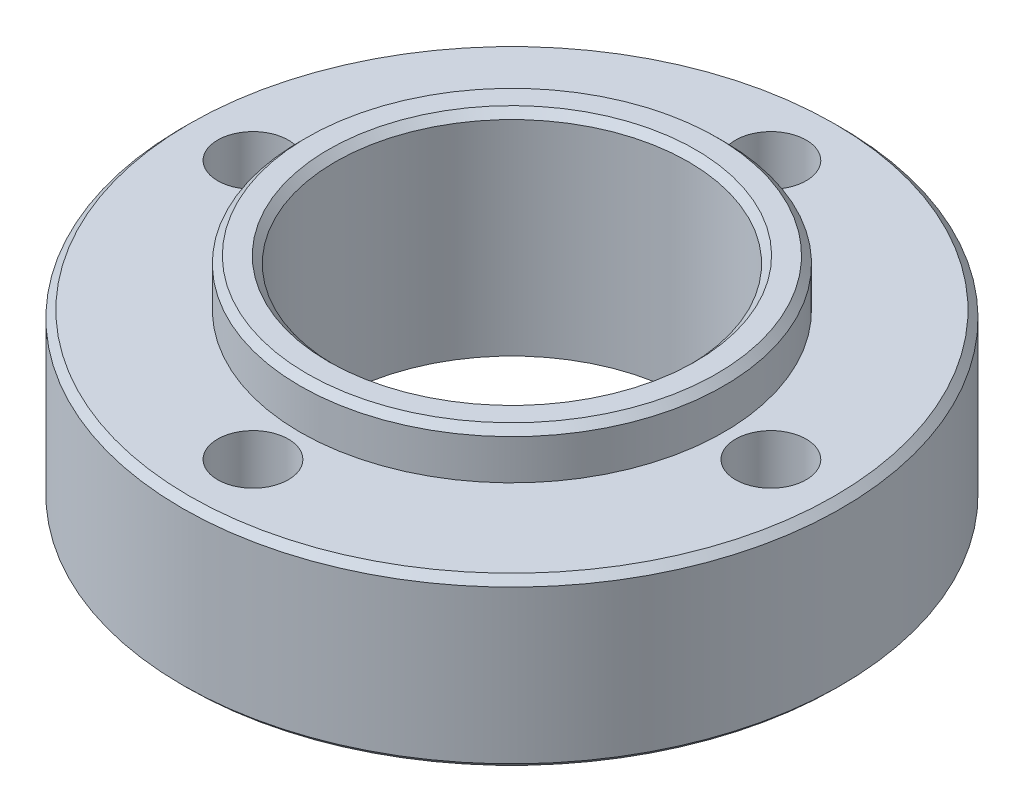
ISO-10303-21;
HEADER;
FILE_DESCRIPTION(('STEP AP214'),'2;1');
FILE_NAME('part.step','',(''),(''),'','','');
FILE_SCHEMA(('AUTOMOTIVE_DESIGN { 1 0 10303 214 1 1 1 1 }'));
ENDSEC;
DATA;
#1=APPLICATION_CONTEXT('core data for automotive mechanical design processes');
#2=APPLICATION_PROTOCOL_DEFINITION('international standard','automotive_design',2000,#1);
#3=PRODUCT_CONTEXT('',#1,'mechanical');
#4=PRODUCT('Part','Part','',(#3));
#5=PRODUCT_RELATED_PRODUCT_CATEGORY('part','',(#4));
#6=PRODUCT_DEFINITION_FORMATION('','',#4);
#7=PRODUCT_DEFINITION_CONTEXT('part definition',#1,'design');
#8=PRODUCT_DEFINITION('design','',#6,#7);
#9=PRODUCT_DEFINITION_SHAPE('','',#8);
#10=(LENGTH_UNIT() NAMED_UNIT(*) SI_UNIT(.MILLI.,.METRE.));
#11=(NAMED_UNIT(*) PLANE_ANGLE_UNIT() SI_UNIT($,.RADIAN.));
#12=(NAMED_UNIT(*) SI_UNIT($,.STERADIAN.) SOLID_ANGLE_UNIT());
#13=UNCERTAINTY_MEASURE_WITH_UNIT(LENGTH_MEASURE(1.E-05),#10,'distance_accuracy_value','');
#14=(GEOMETRIC_REPRESENTATION_CONTEXT(3) GLOBAL_UNCERTAINTY_ASSIGNED_CONTEXT((#13)) GLOBAL_UNIT_ASSIGNED_CONTEXT((#10,
#11,#12)) REPRESENTATION_CONTEXT('',''));
#15=CARTESIAN_POINT('',(0.,0.,0.));
#16=DIRECTION('',(0.,0.,1.));
#17=DIRECTION('',(1.,0.,0.));
#18=AXIS2_PLACEMENT_3D('',#15,#16,#17);
#19=CARTESIAN_POINT('',(0.,7.,0.));
#20=DIRECTION('',(0.,1.,0.));
#21=DIRECTION('',(0.,0.,1.));
#22=AXIS2_PLACEMENT_3D('',#19,#20,#21);
#23=PLANE('',#22);
#24=CARTESIAN_POINT('',(0.,7.,0.));
#25=DIRECTION('',(0.,1.,0.));
#26=DIRECTION('',(0.,0.,1.));
#27=AXIS2_PLACEMENT_3D('',#24,#25,#26);
#28=CIRCLE('',#27,13.7);
#29=CARTESIAN_POINT('',(0.,7.,13.7));
#30=VERTEX_POINT('',#29);
#31=EDGE_CURVE('E49',#30,#30,#28,.T.);
#32=ORIENTED_EDGE('',*,*,#31,.T.);
#33=EDGE_LOOP('',(#32));
#34=FACE_BOUND('',#33,.T.);
#35=CARTESIAN_POINT('',(0.,7.,-11.));
#36=DIRECTION('',(0.,1.,0.));
#37=DIRECTION('',(0.,0.,1.));
#38=AXIS2_PLACEMENT_3D('',#35,#36,#37);
#39=CIRCLE('',#38,1.5);
#40=CARTESIAN_POINT('',(0.,7.,-9.5));
#41=VERTEX_POINT('',#40);
#42=EDGE_CURVE('E66',#41,#41,#39,.T.);
#43=ORIENTED_EDGE('',*,*,#42,.F.);
#44=EDGE_LOOP('',(#43));
#45=FACE_BOUND('',#44,.T.);
#46=CARTESIAN_POINT('',(11.0000000000003,7.,-3.11291692255382E-13));
#47=DIRECTION('',(0.,1.,0.));
#48=DIRECTION('',(0.,0.,1.));
#49=AXIS2_PLACEMENT_3D('',#46,#47,#48);
#50=CIRCLE('',#49,1.50000000000024);
#51=CARTESIAN_POINT('',(11.0000000000003,7.,1.49999999999993));
#52=VERTEX_POINT('',#51);
#53=EDGE_CURVE('E86',#52,#52,#50,.T.);
#54=ORIENTED_EDGE('',*,*,#53,.F.);
#55=EDGE_LOOP('',(#54));
#56=FACE_BOUND('',#55,.T.);
#57=CARTESIAN_POINT('',(6.22583384510764E-13,7.,11.));
#58=DIRECTION('',(0.,1.,0.));
#59=DIRECTION('',(0.,0.,1.));
#60=AXIS2_PLACEMENT_3D('',#57,#58,#59);
#61=CIRCLE('',#60,1.50000000000067);
#62=CARTESIAN_POINT('',(6.22583384510764E-13,7.,12.5000000000007));
#63=VERTEX_POINT('',#62);
#64=EDGE_CURVE('E89',#63,#63,#61,.T.);
#65=ORIENTED_EDGE('',*,*,#64,.F.);
#66=EDGE_LOOP('',(#65));
#67=FACE_BOUND('',#66,.T.);
#68=CARTESIAN_POINT('',(-10.9999999999997,7.,3.12638803734444E-13));
#69=DIRECTION('',(0.,1.,0.));
#70=DIRECTION('',(0.,0.,1.));
#71=AXIS2_PLACEMENT_3D('',#68,#69,#70);
#72=CIRCLE('',#71,1.5000000000005);
#73=CARTESIAN_POINT('',(-10.9999999999997,7.,1.50000000000081));
#74=VERTEX_POINT('',#73);
#75=EDGE_CURVE('E70',#74,#74,#72,.T.);
#76=ORIENTED_EDGE('',*,*,#75,.F.);
#77=EDGE_LOOP('',(#76));
#78=FACE_BOUND('',#77,.T.);
#79=CARTESIAN_POINT('',(0.,7.,0.));
#80=DIRECTION('',(0.,1.,0.));
#81=DIRECTION('',(0.,0.,1.));
#82=AXIS2_PLACEMENT_3D('',#79,#80,#81);
#83=CIRCLE('',#82,9.);
#84=CARTESIAN_POINT('',(0.,7.,9.));
#85=VERTEX_POINT('',#84);
#86=EDGE_CURVE('E83',#85,#85,#83,.F.);
#87=ORIENTED_EDGE('',*,*,#86,.T.);
#88=EDGE_LOOP('',(#87));
#89=FACE_BOUND('',#88,.T.);
#90=ADVANCED_FACE('F34',(#34,#45,#56,#67,#78,#89),#23,.T.);
#91=CARTESIAN_POINT('',(0.,7.,0.));
#92=DIRECTION('',(0.,-1.,0.));
#93=DIRECTION('',(0.,0.,-1.));
#94=AXIS2_PLACEMENT_3D('',#91,#92,#93);
#95=CYLINDRICAL_SURFACE('',#94,14.);
#96=CARTESIAN_POINT('',(0.,0.200000000000006,0.));
#97=DIRECTION('',(0.,1.,0.));
#98=DIRECTION('',(0.,0.,1.));
#99=AXIS2_PLACEMENT_3D('',#96,#97,#98);
#100=CIRCLE('',#99,14.);
#101=CARTESIAN_POINT('',(0.,0.200000000000006,14.));
#102=VERTEX_POINT('',#101);
#103=EDGE_CURVE('E41',#102,#102,#100,.T.);
#104=ORIENTED_EDGE('',*,*,#103,.T.);
#105=EDGE_LOOP('',(#104));
#106=FACE_BOUND('',#105,.T.);
#107=CARTESIAN_POINT('',(0.,6.70000000000001,0.));
#108=DIRECTION('',(0.,1.,0.));
#109=DIRECTION('',(0.,0.,1.));
#110=AXIS2_PLACEMENT_3D('',#107,#108,#109);
#111=CIRCLE('',#110,14.);
#112=CARTESIAN_POINT('',(0.,6.70000000000001,14.));
#113=VERTEX_POINT('',#112);
#114=EDGE_CURVE('E45',#113,#113,#111,.F.);
#115=ORIENTED_EDGE('',*,*,#114,.T.);
#116=EDGE_LOOP('',(#115));
#117=FACE_BOUND('',#116,.T.);
#118=ADVANCED_FACE('F115',(#106,#117),#95,.T.);
#119=CARTESIAN_POINT('',(0.,7.,-11.));
#120=DIRECTION('',(0.,-1.,0.));
#121=DIRECTION('',(0.,0.,-1.));
#122=AXIS2_PLACEMENT_3D('',#119,#120,#121);
#123=CYLINDRICAL_SURFACE('',#122,1.5);
#124=ORIENTED_EDGE('',*,*,#42,.T.);
#125=EDGE_LOOP('',(#124));
#126=FACE_BOUND('',#125,.T.);
#127=CARTESIAN_POINT('',(0.,0.,-11.));
#128=DIRECTION('',(0.,1.,0.));
#129=DIRECTION('',(0.,0.,1.));
#130=AXIS2_PLACEMENT_3D('',#127,#128,#129);
#131=CIRCLE('',#130,1.5);
#132=CARTESIAN_POINT('',(0.,0.,-9.5));
#133=VERTEX_POINT('',#132);
#134=EDGE_CURVE('E71',#133,#133,#131,.T.);
#135=ORIENTED_EDGE('',*,*,#134,.F.);
#136=EDGE_LOOP('',(#135));
#137=FACE_BOUND('',#136,.T.);
#138=ADVANCED_FACE('F120',(#126,#137),#123,.F.);
#139=CARTESIAN_POINT('',(11.0000000000003,7.,-3.11291692255382E-13));
#140=DIRECTION('',(0.,-1.,0.));
#141=DIRECTION('',(0.,0.,-1.));
#142=AXIS2_PLACEMENT_3D('',#139,#140,#141);
#143=CYLINDRICAL_SURFACE('',#142,1.50000000000024);
#144=ORIENTED_EDGE('',*,*,#53,.T.);
#145=EDGE_LOOP('',(#144));
#146=FACE_BOUND('',#145,.T.);
#147=CARTESIAN_POINT('',(11.0000000000003,0.,-3.11291692255382E-13));
#148=DIRECTION('',(0.,1.,0.));
#149=DIRECTION('',(0.,0.,1.));
#150=AXIS2_PLACEMENT_3D('',#147,#148,#149);
#151=CIRCLE('',#150,1.50000000000024);
#152=CARTESIAN_POINT('',(11.0000000000003,0.,1.49999999999993));
#153=VERTEX_POINT('',#152);
#154=EDGE_CURVE('E74',#153,#153,#151,.T.);
#155=ORIENTED_EDGE('',*,*,#154,.F.);
#156=EDGE_LOOP('',(#155));
#157=FACE_BOUND('',#156,.T.);
#158=ADVANCED_FACE('F130',(#146,#157),#143,.F.);
#159=CARTESIAN_POINT('',(6.22583384510764E-13,7.,11.));
#160=DIRECTION('',(0.,-1.,0.));
#161=DIRECTION('',(0.,0.,-1.));
#162=AXIS2_PLACEMENT_3D('',#159,#160,#161);
#163=CYLINDRICAL_SURFACE('',#162,1.50000000000067);
#164=ORIENTED_EDGE('',*,*,#64,.T.);
#165=EDGE_LOOP('',(#164));
#166=FACE_BOUND('',#165,.T.);
#167=CARTESIAN_POINT('',(6.22583384510764E-13,0.,11.));
#168=DIRECTION('',(0.,1.,0.));
#169=DIRECTION('',(0.,0.,1.));
#170=AXIS2_PLACEMENT_3D('',#167,#168,#169);
#171=CIRCLE('',#170,1.50000000000067);
#172=CARTESIAN_POINT('',(6.22583384510764E-13,0.,12.5000000000007));
#173=VERTEX_POINT('',#172);
#174=EDGE_CURVE('E77',#173,#173,#171,.T.);
#175=ORIENTED_EDGE('',*,*,#174,.F.);
#176=EDGE_LOOP('',(#175));
#177=FACE_BOUND('',#176,.T.);
#178=ADVANCED_FACE('F134',(#166,#177),#163,.F.);
#179=CARTESIAN_POINT('',(-10.9999999999997,7.,3.12638803734444E-13));
#180=DIRECTION('',(0.,-1.,0.));
#181=DIRECTION('',(0.,0.,-1.));
#182=AXIS2_PLACEMENT_3D('',#179,#180,#181);
#183=CYLINDRICAL_SURFACE('',#182,1.5000000000005);
#184=ORIENTED_EDGE('',*,*,#75,.T.);
#185=EDGE_LOOP('',(#184));
#186=FACE_BOUND('',#185,.T.);
#187=CARTESIAN_POINT('',(-10.9999999999997,0.,3.12638803734444E-13));
#188=DIRECTION('',(0.,1.,0.));
#189=DIRECTION('',(0.,0.,1.));
#190=AXIS2_PLACEMENT_3D('',#187,#188,#189);
#191=CIRCLE('',#190,1.5000000000005);
#192=CARTESIAN_POINT('',(-10.9999999999997,0.,1.50000000000081));
#193=VERTEX_POINT('',#192);
#194=EDGE_CURVE('E80',#193,#193,#191,.T.);
#195=ORIENTED_EDGE('',*,*,#194,.F.);
#196=EDGE_LOOP('',(#195));
#197=FACE_BOUND('',#196,.T.);
#198=ADVANCED_FACE('F125',(#186,#197),#183,.F.);
#199=CARTESIAN_POINT('',(0.,7.,0.));
#200=DIRECTION('',(0.,-1.,0.));
#201=DIRECTION('',(0.,0.,-1.));
#202=AXIS2_PLACEMENT_3D('',#199,#200,#201);
#203=CYLINDRICAL_SURFACE('',#202,7.5);
#204=CARTESIAN_POINT('',(0.,8.69999999999999,0.));
#205=DIRECTION('',(0.,1.,0.));
#206=DIRECTION('',(0.,0.,1.));
#207=AXIS2_PLACEMENT_3D('',#204,#205,#206);
#208=CIRCLE('',#207,7.5);
#209=CARTESIAN_POINT('',(0.,8.69999999999999,7.5));
#210=VERTEX_POINT('',#209);
#211=EDGE_CURVE('E63',#210,#210,#208,.T.);
#212=ORIENTED_EDGE('',*,*,#211,.T.);
#213=EDGE_LOOP('',(#212));
#214=FACE_BOUND('',#213,.T.);
#215=CARTESIAN_POINT('',(0.,0.,0.));
#216=DIRECTION('',(0.,1.,0.));
#217=DIRECTION('',(0.,0.,1.));
#218=AXIS2_PLACEMENT_3D('',#215,#216,#217);
#219=CIRCLE('',#218,7.5);
#220=CARTESIAN_POINT('',(0.,0.,7.5));
#221=VERTEX_POINT('',#220);
#222=EDGE_CURVE('E67',#221,#221,#219,.T.);
#223=ORIENTED_EDGE('',*,*,#222,.F.);
#224=EDGE_LOOP('',(#223));
#225=FACE_BOUND('',#224,.T.);
#226=ADVANCED_FACE('F111',(#214,#225),#203,.F.);
#227=CARTESIAN_POINT('',(0.,0.,0.));
#228=DIRECTION('',(0.,1.,0.));
#229=DIRECTION('',(0.,0.,1.));
#230=AXIS2_PLACEMENT_3D('',#227,#228,#229);
#231=PLANE('',#230);
#232=CARTESIAN_POINT('',(0.,0.,0.));
#233=DIRECTION('',(0.,1.,0.));
#234=DIRECTION('',(0.,0.,1.));
#235=AXIS2_PLACEMENT_3D('',#232,#233,#234);
#236=CIRCLE('',#235,13.8);
#237=CARTESIAN_POINT('',(0.,0.,13.8));
#238=VERTEX_POINT('',#237);
#239=EDGE_CURVE('E10',#238,#238,#236,.F.);
#240=ORIENTED_EDGE('',*,*,#239,.T.);
#241=EDGE_LOOP('',(#240));
#242=FACE_BOUND('',#241,.T.);
#243=ORIENTED_EDGE('',*,*,#222,.T.);
#244=EDGE_LOOP('',(#243));
#245=FACE_BOUND('',#244,.T.);
#246=ORIENTED_EDGE('',*,*,#134,.T.);
#247=EDGE_LOOP('',(#246));
#248=FACE_BOUND('',#247,.T.);
#249=ORIENTED_EDGE('',*,*,#154,.T.);
#250=EDGE_LOOP('',(#249));
#251=FACE_BOUND('',#250,.T.);
#252=ORIENTED_EDGE('',*,*,#174,.T.);
#253=EDGE_LOOP('',(#252));
#254=FACE_BOUND('',#253,.T.);
#255=ORIENTED_EDGE('',*,*,#194,.T.);
#256=EDGE_LOOP('',(#255));
#257=FACE_BOUND('',#256,.T.);
#258=ADVANCED_FACE('F101',(#242,#245,#248,#251,#254,#257),#231,.F.);
#259=CARTESIAN_POINT('',(0.,9.,0.));
#260=DIRECTION('',(0.,-1.,0.));
#261=DIRECTION('',(0.,0.,-1.));
#262=AXIS2_PLACEMENT_3D('',#259,#260,#261);
#263=CYLINDRICAL_SURFACE('',#262,9.);
#264=CARTESIAN_POINT('',(0.,8.7,0.));
#265=DIRECTION('',(0.,1.,0.));
#266=DIRECTION('',(0.,0.,1.));
#267=AXIS2_PLACEMENT_3D('',#264,#265,#266);
#268=CIRCLE('',#267,9.);
#269=CARTESIAN_POINT('',(0.,8.7,9.));
#270=VERTEX_POINT('',#269);
#271=EDGE_CURVE('E54',#270,#270,#268,.F.);
#272=ORIENTED_EDGE('',*,*,#271,.T.);
#273=EDGE_LOOP('',(#272));
#274=FACE_BOUND('',#273,.T.);
#275=ORIENTED_EDGE('',*,*,#86,.F.);
#276=EDGE_LOOP('',(#275));
#277=FACE_BOUND('',#276,.T.);
#278=ADVANCED_FACE('F98',(#274,#277),#263,.T.);
#279=CARTESIAN_POINT('',(0.,9.,0.));
#280=DIRECTION('',(0.,1.,0.));
#281=DIRECTION('',(0.,0.,1.));
#282=AXIS2_PLACEMENT_3D('',#279,#280,#281);
#283=PLANE('',#282);
#284=CARTESIAN_POINT('',(0.,9.,0.));
#285=DIRECTION('',(0.,1.,0.));
#286=DIRECTION('',(0.,0.,1.));
#287=AXIS2_PLACEMENT_3D('',#284,#285,#286);
#288=CIRCLE('',#287,7.80000000000001);
#289=CARTESIAN_POINT('',(0.,9.,7.80000000000001));
#290=VERTEX_POINT('',#289);
#291=EDGE_CURVE('E57',#290,#290,#288,.F.);
#292=ORIENTED_EDGE('',*,*,#291,.T.);
#293=EDGE_LOOP('',(#292));
#294=FACE_BOUND('',#293,.T.);
#295=CARTESIAN_POINT('',(0.,9.,0.));
#296=DIRECTION('',(0.,1.,0.));
#297=DIRECTION('',(0.,0.,1.));
#298=AXIS2_PLACEMENT_3D('',#295,#296,#297);
#299=CIRCLE('',#298,8.7);
#300=CARTESIAN_POINT('',(0.,9.,8.7));
#301=VERTEX_POINT('',#300);
#302=EDGE_CURVE('E60',#301,#301,#299,.T.);
#303=ORIENTED_EDGE('',*,*,#302,.T.);
#304=EDGE_LOOP('',(#303));
#305=FACE_BOUND('',#304,.T.);
#306=ADVANCED_FACE('F100',(#294,#305),#283,.T.);
#307=CARTESIAN_POINT('',(0.,8.69999999999999,0.));
#308=DIRECTION('',(0.,1.,0.));
#309=DIRECTION('',(0.,0.,1.));
#310=AXIS2_PLACEMENT_3D('',#307,#308,#309);
#311=CONICAL_SURFACE('',#310,7.5,0.785398163397448);
#312=ORIENTED_EDGE('',*,*,#291,.F.);
#313=EDGE_LOOP('',(#312));
#314=FACE_BOUND('',#313,.T.);
#315=ORIENTED_EDGE('',*,*,#211,.F.);
#316=EDGE_LOOP('',(#315));
#317=FACE_BOUND('',#316,.T.);
#318=ADVANCED_FACE('F108',(#314,#317),#311,.F.);
#319=CARTESIAN_POINT('',(0.,9.,0.));
#320=DIRECTION('',(0.,-1.,0.));
#321=DIRECTION('',(0.,0.,-1.));
#322=AXIS2_PLACEMENT_3D('',#319,#320,#321);
#323=CONICAL_SURFACE('',#322,8.7,0.785398163397443);
#324=ORIENTED_EDGE('',*,*,#271,.F.);
#325=EDGE_LOOP('',(#324));
#326=FACE_BOUND('',#325,.T.);
#327=ORIENTED_EDGE('',*,*,#302,.F.);
#328=EDGE_LOOP('',(#327));
#329=FACE_BOUND('',#328,.T.);
#330=ADVANCED_FACE('F144',(#326,#329),#323,.T.);
#331=CARTESIAN_POINT('',(0.,7.,0.));
#332=DIRECTION('',(0.,-1.,0.));
#333=DIRECTION('',(0.,0.,-1.));
#334=AXIS2_PLACEMENT_3D('',#331,#332,#333);
#335=CONICAL_SURFACE('',#334,13.7,0.785398163397454);
#336=ORIENTED_EDGE('',*,*,#114,.F.);
#337=EDGE_LOOP('',(#336));
#338=FACE_BOUND('',#337,.T.);
#339=ORIENTED_EDGE('',*,*,#31,.F.);
#340=EDGE_LOOP('',(#339));
#341=FACE_BOUND('',#340,.T.);
#342=ADVANCED_FACE('F147',(#338,#341),#335,.T.);
#343=CARTESIAN_POINT('',(0.,0.200000000000006,0.));
#344=DIRECTION('',(0.,1.,0.));
#345=DIRECTION('',(0.,0.,1.));
#346=AXIS2_PLACEMENT_3D('',#343,#344,#345);
#347=CONICAL_SURFACE('',#346,14.,0.785398163397448);
#348=ORIENTED_EDGE('',*,*,#239,.F.);
#349=EDGE_LOOP('',(#348));
#350=FACE_BOUND('',#349,.T.);
#351=ORIENTED_EDGE('',*,*,#103,.F.);
#352=EDGE_LOOP('',(#351));
#353=FACE_BOUND('',#352,.T.);
#354=ADVANCED_FACE('F36',(#350,#353),#347,.T.);
#355=CLOSED_SHELL('',(#90,#118,#138,#158,#178,#198,#226,#258,#278,#306,#318,#330,#342,#354));
#356=MANIFOLD_SOLID_BREP('B2',#355);
#357=ADVANCED_BREP_SHAPE_REPRESENTATION('',(#18,#356),#14);
#358=SHAPE_DEFINITION_REPRESENTATION(#9,#357);
ENDSEC;
END-ISO-10303-21;
